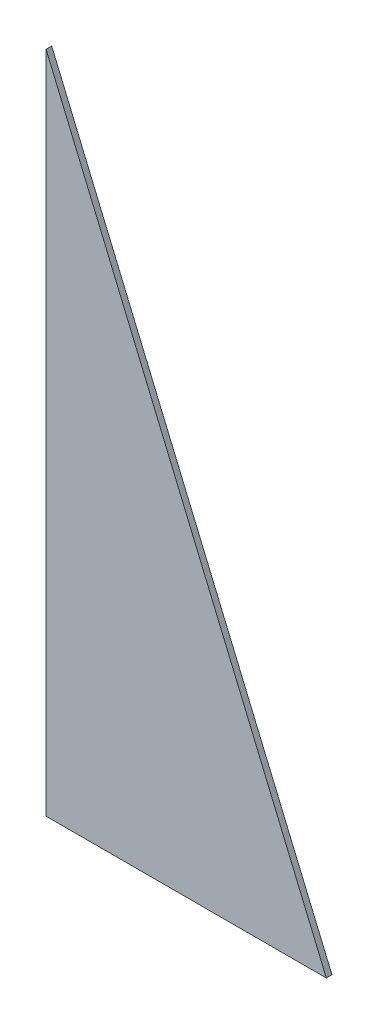
ISO-10303-21;
HEADER;
FILE_DESCRIPTION(('STEP AP214'),'2;1');
FILE_NAME('part.step','',(''),(''),'','','');
FILE_SCHEMA(('AUTOMOTIVE_DESIGN { 1 0 10303 214 1 1 1 1 }'));
ENDSEC;
DATA;
#1=APPLICATION_CONTEXT('core data for automotive mechanical design processes');
#2=APPLICATION_PROTOCOL_DEFINITION('international standard','automotive_design',2000,#1);
#3=PRODUCT_CONTEXT('',#1,'mechanical');
#4=PRODUCT('Part','Part','',(#3));
#5=PRODUCT_RELATED_PRODUCT_CATEGORY('part','',(#4));
#6=PRODUCT_DEFINITION_FORMATION('','',#4);
#7=PRODUCT_DEFINITION_CONTEXT('part definition',#1,'design');
#8=PRODUCT_DEFINITION('design','',#6,#7);
#9=PRODUCT_DEFINITION_SHAPE('','',#8);
#10=(LENGTH_UNIT() NAMED_UNIT(*) SI_UNIT(.MILLI.,.METRE.));
#11=(NAMED_UNIT(*) PLANE_ANGLE_UNIT() SI_UNIT($,.RADIAN.));
#12=(NAMED_UNIT(*) SI_UNIT($,.STERADIAN.) SOLID_ANGLE_UNIT());
#13=UNCERTAINTY_MEASURE_WITH_UNIT(LENGTH_MEASURE(1.E-05),#10,'distance_accuracy_value','');
#14=(GEOMETRIC_REPRESENTATION_CONTEXT(3) GLOBAL_UNCERTAINTY_ASSIGNED_CONTEXT((#13)) GLOBAL_UNIT_ASSIGNED_CONTEXT((#10,
#11,#12)) REPRESENTATION_CONTEXT('',''));
#15=CARTESIAN_POINT('',(0.,0.,0.));
#16=DIRECTION('',(0.,0.,1.));
#17=DIRECTION('',(1.,0.,0.));
#18=AXIS2_PLACEMENT_3D('',#15,#16,#17);
#19=CARTESIAN_POINT('',(-50.,118.5,2.));
#20=DIRECTION('',(1.,0.,0.));
#21=DIRECTION('',(0.,1.,0.));
#22=AXIS2_PLACEMENT_3D('',#19,#20,#21);
#23=PLANE('',#22);
#24=DIRECTION('',(0.,-1.,0.));
#25=VECTOR('',#24,1.);
#26=CARTESIAN_POINT('',(-50.,118.5,0.));
#27=LINE('',#26,#25);
#28=CARTESIAN_POINT('',(-50.,118.5,0.));
#29=VERTEX_POINT('',#28);
#30=CARTESIAN_POINT('',(-50.,-118.5,0.));
#31=VERTEX_POINT('',#30);
#32=EDGE_CURVE('E72',#29,#31,#27,.T.);
#33=ORIENTED_EDGE('',*,*,#32,.T.);
#34=DIRECTION('',(0.,0.,-1.));
#35=VECTOR('',#34,1.);
#36=CARTESIAN_POINT('',(-50.,-118.5,2.));
#37=LINE('',#36,#35);
#38=CARTESIAN_POINT('',(-50.,-118.5,2.));
#39=VERTEX_POINT('',#38);
#40=EDGE_CURVE('E54',#39,#31,#37,.T.);
#41=ORIENTED_EDGE('',*,*,#40,.F.);
#42=DIRECTION('',(0.,-1.,0.));
#43=VECTOR('',#42,1.);
#44=CARTESIAN_POINT('',(-50.,118.5,2.));
#45=LINE('',#44,#43);
#46=CARTESIAN_POINT('',(-50.,118.5,2.));
#47=VERTEX_POINT('',#46);
#48=EDGE_CURVE('E61',#47,#39,#45,.T.);
#49=ORIENTED_EDGE('',*,*,#48,.F.);
#50=DIRECTION('',(0.,0.,-1.));
#51=VECTOR('',#50,1.);
#52=CARTESIAN_POINT('',(-50.,118.5,2.));
#53=LINE('',#52,#51);
#54=EDGE_CURVE('E11',#47,#29,#53,.T.);
#55=ORIENTED_EDGE('',*,*,#54,.T.);
#56=EDGE_LOOP('',(#33,#41,#49,#55));
#57=FACE_BOUND('',#56,.T.);
#58=ADVANCED_FACE('F45',(#57),#23,.F.);
#59=CARTESIAN_POINT('',(-50.,-118.5,2.));
#60=DIRECTION('',(0.,1.,0.));
#61=DIRECTION('',(0.,0.,1.));
#62=AXIS2_PLACEMENT_3D('',#59,#60,#61);
#63=PLANE('',#62);
#64=DIRECTION('',(1.,0.,0.));
#65=VECTOR('',#64,1.);
#66=CARTESIAN_POINT('',(-50.,-118.5,0.));
#67=LINE('',#66,#65);
#68=CARTESIAN_POINT('',(50.,-118.5,0.));
#69=VERTEX_POINT('',#68);
#70=EDGE_CURVE('E91',#31,#69,#67,.T.);
#71=ORIENTED_EDGE('',*,*,#70,.T.);
#72=DIRECTION('',(0.,0.,-1.));
#73=VECTOR('',#72,1.);
#74=CARTESIAN_POINT('',(50.,-118.5,2.));
#75=LINE('',#74,#73);
#76=CARTESIAN_POINT('',(50.,-118.5,2.));
#77=VERTEX_POINT('',#76);
#78=EDGE_CURVE('E95',#77,#69,#75,.T.);
#79=ORIENTED_EDGE('',*,*,#78,.F.);
#80=DIRECTION('',(1.,0.,0.));
#81=VECTOR('',#80,1.);
#82=CARTESIAN_POINT('',(-50.,-118.5,2.));
#83=LINE('',#82,#81);
#84=EDGE_CURVE('E86',#39,#77,#83,.T.);
#85=ORIENTED_EDGE('',*,*,#84,.F.);
#86=ORIENTED_EDGE('',*,*,#40,.T.);
#87=EDGE_LOOP('',(#71,#79,#85,#86));
#88=FACE_BOUND('',#87,.T.);
#89=ADVANCED_FACE('F107',(#88),#63,.F.);
#90=CARTESIAN_POINT('',(0.,0.,2.));
#91=DIRECTION('',(0.,0.,1.));
#92=DIRECTION('',(1.,0.,0.));
#93=AXIS2_PLACEMENT_3D('',#90,#91,#92);
#94=PLANE('',#93);
#95=DIRECTION('',(0.388752069836941,-0.92134240551355,0.));
#96=VECTOR('',#95,1.);
#97=CARTESIAN_POINT('',(-50.,118.5,2.));
#98=LINE('',#97,#96);
#99=EDGE_CURVE('E83',#47,#77,#98,.T.);
#100=ORIENTED_EDGE('',*,*,#99,.F.);
#101=ORIENTED_EDGE('',*,*,#48,.T.);
#102=ORIENTED_EDGE('',*,*,#84,.T.);
#103=EDGE_LOOP('',(#100,#101,#102));
#104=FACE_BOUND('',#103,.T.);
#105=ADVANCED_FACE('F84',(#104),#94,.T.);
#106=CARTESIAN_POINT('',(0.,0.,0.));
#107=DIRECTION('',(0.,0.,1.));
#108=DIRECTION('',(1.,0.,0.));
#109=AXIS2_PLACEMENT_3D('',#106,#107,#108);
#110=PLANE('',#109);
#111=ORIENTED_EDGE('',*,*,#32,.F.);
#112=DIRECTION('',(0.388752069836941,-0.92134240551355,0.));
#113=VECTOR('',#112,1.);
#114=CARTESIAN_POINT('',(-50.,118.5,0.));
#115=LINE('',#114,#113);
#116=EDGE_CURVE('E79',#29,#69,#115,.T.);
#117=ORIENTED_EDGE('',*,*,#116,.T.);
#118=ORIENTED_EDGE('',*,*,#70,.F.);
#119=EDGE_LOOP('',(#111,#117,#118));
#120=FACE_BOUND('',#119,.T.);
#121=ADVANCED_FACE('F109',(#120),#110,.F.);
#122=CARTESIAN_POINT('',(-50.,118.5,0.));
#123=DIRECTION('',(-0.92134240551355,-0.388752069836941,0.));
#124=DIRECTION('',(0.388752069836941,-0.92134240551355,0.));
#125=AXIS2_PLACEMENT_3D('',#122,#123,#124);
#126=PLANE('',#125);
#127=ORIENTED_EDGE('',*,*,#99,.T.);
#128=ORIENTED_EDGE('',*,*,#78,.T.);
#129=ORIENTED_EDGE('',*,*,#116,.F.);
#130=ORIENTED_EDGE('',*,*,#54,.F.);
#131=EDGE_LOOP('',(#127,#128,#129,#130));
#132=FACE_BOUND('',#131,.T.);
#133=ADVANCED_FACE('F82',(#132),#126,.F.);
#134=CLOSED_SHELL('',(#58,#89,#105,#121,#133));
#135=MANIFOLD_SOLID_BREP('B2',#134);
#136=ADVANCED_BREP_SHAPE_REPRESENTATION('',(#18,#135),#14);
#137=SHAPE_DEFINITION_REPRESENTATION(#9,#136);
ENDSEC;
END-ISO-10303-21;
